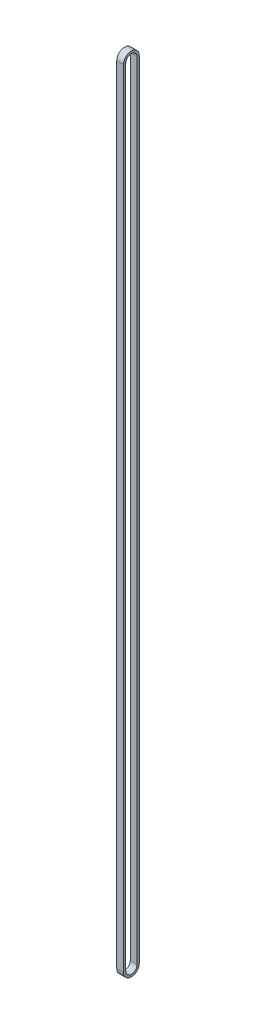
ISO-10303-21;
HEADER;
FILE_DESCRIPTION(('STEP AP214'),'2;1');
FILE_NAME('part.step','',(''),(''),'','','');
FILE_SCHEMA(('AUTOMOTIVE_DESIGN { 1 0 10303 214 1 1 1 1 }'));
ENDSEC;
DATA;
#1=APPLICATION_CONTEXT('core data for automotive mechanical design processes');
#2=APPLICATION_PROTOCOL_DEFINITION('international standard','automotive_design',2000,#1);
#3=PRODUCT_CONTEXT('',#1,'mechanical');
#4=PRODUCT('Part','Part','',(#3));
#5=PRODUCT_RELATED_PRODUCT_CATEGORY('part','',(#4));
#6=PRODUCT_DEFINITION_FORMATION('','',#4);
#7=PRODUCT_DEFINITION_CONTEXT('part definition',#1,'design');
#8=PRODUCT_DEFINITION('design','',#6,#7);
#9=PRODUCT_DEFINITION_SHAPE('','',#8);
#10=(LENGTH_UNIT() NAMED_UNIT(*) SI_UNIT(.MILLI.,.METRE.));
#11=(NAMED_UNIT(*) PLANE_ANGLE_UNIT() SI_UNIT($,.RADIAN.));
#12=(NAMED_UNIT(*) SI_UNIT($,.STERADIAN.) SOLID_ANGLE_UNIT());
#13=UNCERTAINTY_MEASURE_WITH_UNIT(LENGTH_MEASURE(1.E-05),#10,'distance_accuracy_value','');
#14=(GEOMETRIC_REPRESENTATION_CONTEXT(3) GLOBAL_UNCERTAINTY_ASSIGNED_CONTEXT((#13)) GLOBAL_UNIT_ASSIGNED_CONTEXT((#10,
#11,#12)) REPRESENTATION_CONTEXT('',''));
#15=CARTESIAN_POINT('',(0.,0.,0.));
#16=DIRECTION('',(0.,0.,1.));
#17=DIRECTION('',(1.,0.,0.));
#18=AXIS2_PLACEMENT_3D('',#15,#16,#17);
#19=CARTESIAN_POINT('',(3.,0.,0.));
#20=DIRECTION('',(1.,0.,0.));
#21=DIRECTION('',(0.,0.,-1.));
#22=AXIS2_PLACEMENT_3D('',#19,#20,#21);
#23=PLANE('',#22);
#24=CARTESIAN_POINT('',(3.,0.,0.));
#25=DIRECTION('',(1.,0.,0.));
#26=DIRECTION('',(0.,0.,-1.));
#27=AXIS2_PLACEMENT_3D('',#24,#25,#26);
#28=CIRCLE('',#27,7.);
#29=CARTESIAN_POINT('',(3.,0.,7.));
#30=VERTEX_POINT('',#29);
#31=CARTESIAN_POINT('',(3.,0.,-7.));
#32=VERTEX_POINT('',#31);
#33=EDGE_CURVE('E153',#30,#32,#28,.T.);
#34=ORIENTED_EDGE('',*,*,#33,.T.);
#35=DIRECTION('',(0.,1.,0.));
#36=VECTOR('',#35,1.);
#37=CARTESIAN_POINT('',(3.,0.,-7.));
#38=LINE('',#37,#36);
#39=CARTESIAN_POINT('',(3.,698.,-7.));
#40=VERTEX_POINT('',#39);
#41=EDGE_CURVE('E156',#32,#40,#38,.T.);
#42=ORIENTED_EDGE('',*,*,#41,.T.);
#43=CARTESIAN_POINT('',(3.,698.,0.));
#44=DIRECTION('',(1.,0.,0.));
#45=DIRECTION('',(0.,0.,-1.));
#46=AXIS2_PLACEMENT_3D('',#43,#44,#45);
#47=CIRCLE('',#46,7.);
#48=CARTESIAN_POINT('',(3.,698.,7.));
#49=VERTEX_POINT('',#48);
#50=EDGE_CURVE('E159',#40,#49,#47,.T.);
#51=ORIENTED_EDGE('',*,*,#50,.T.);
#52=DIRECTION('',(0.,-1.,0.));
#53=VECTOR('',#52,1.);
#54=CARTESIAN_POINT('',(3.,0.,7.));
#55=LINE('',#54,#53);
#56=EDGE_CURVE('E162',#49,#30,#55,.T.);
#57=ORIENTED_EDGE('',*,*,#56,.T.);
#58=EDGE_LOOP('',(#34,#42,#51,#57));
#59=FACE_BOUND('',#58,.T.);
#60=DIRECTION('',(0.,1.,0.));
#61=VECTOR('',#60,1.);
#62=CARTESIAN_POINT('',(3.,0.,-5.));
#63=LINE('',#62,#61);
#64=CARTESIAN_POINT('',(3.,0.,-5.));
#65=VERTEX_POINT('',#64);
#66=CARTESIAN_POINT('',(3.,698.,-5.));
#67=VERTEX_POINT('',#66);
#68=EDGE_CURVE('E115',#65,#67,#63,.T.);
#69=ORIENTED_EDGE('',*,*,#68,.F.);
#70=CARTESIAN_POINT('',(3.,0.,0.));
#71=DIRECTION('',(1.,0.,0.));
#72=DIRECTION('',(0.,0.,-1.));
#73=AXIS2_PLACEMENT_3D('',#70,#71,#72);
#74=CIRCLE('',#73,5.);
#75=CARTESIAN_POINT('',(3.,0.,5.));
#76=VERTEX_POINT('',#75);
#77=EDGE_CURVE('E107',#76,#65,#74,.T.);
#78=ORIENTED_EDGE('',*,*,#77,.F.);
#79=DIRECTION('',(0.,-1.,0.));
#80=VECTOR('',#79,1.);
#81=CARTESIAN_POINT('',(3.,0.,5.));
#82=LINE('',#81,#80);
#83=CARTESIAN_POINT('',(3.,698.,5.));
#84=VERTEX_POINT('',#83);
#85=EDGE_CURVE('E133',#84,#76,#82,.T.);
#86=ORIENTED_EDGE('',*,*,#85,.F.);
#87=CARTESIAN_POINT('',(3.,698.,0.));
#88=DIRECTION('',(1.,0.,0.));
#89=DIRECTION('',(0.,0.,-1.));
#90=AXIS2_PLACEMENT_3D('',#87,#88,#89);
#91=CIRCLE('',#90,5.);
#92=EDGE_CURVE('E127',#67,#84,#91,.T.);
#93=ORIENTED_EDGE('',*,*,#92,.F.);
#94=EDGE_LOOP('',(#69,#78,#86,#93));
#95=FACE_BOUND('',#94,.T.);
#96=ADVANCED_FACE('F34',(#59,#95),#23,.T.);
#97=CARTESIAN_POINT('',(-3.,0.,0.));
#98=DIRECTION('',(1.,0.,0.));
#99=DIRECTION('',(0.,0.,-1.));
#100=AXIS2_PLACEMENT_3D('',#97,#98,#99);
#101=PLANE('',#100);
#102=CARTESIAN_POINT('',(-3.,0.,0.));
#103=DIRECTION('',(1.,0.,0.));
#104=DIRECTION('',(0.,0.,-1.));
#105=AXIS2_PLACEMENT_3D('',#102,#103,#104);
#106=CIRCLE('',#105,7.);
#107=CARTESIAN_POINT('',(-3.,0.,7.));
#108=VERTEX_POINT('',#107);
#109=CARTESIAN_POINT('',(-3.,0.,-7.));
#110=VERTEX_POINT('',#109);
#111=EDGE_CURVE('E123',#108,#110,#106,.T.);
#112=ORIENTED_EDGE('',*,*,#111,.F.);
#113=DIRECTION('',(0.,-1.,0.));
#114=VECTOR('',#113,1.);
#115=CARTESIAN_POINT('',(-3.,0.,7.));
#116=LINE('',#115,#114);
#117=CARTESIAN_POINT('',(-3.,698.,7.));
#118=VERTEX_POINT('',#117);
#119=EDGE_CURVE('E157',#118,#108,#116,.T.);
#120=ORIENTED_EDGE('',*,*,#119,.F.);
#121=CARTESIAN_POINT('',(-3.,698.,0.));
#122=DIRECTION('',(1.,0.,0.));
#123=DIRECTION('',(0.,0.,-1.));
#124=AXIS2_PLACEMENT_3D('',#121,#122,#123);
#125=CIRCLE('',#124,7.);
#126=CARTESIAN_POINT('',(-3.,698.,-7.));
#127=VERTEX_POINT('',#126);
#128=EDGE_CURVE('E170',#127,#118,#125,.T.);
#129=ORIENTED_EDGE('',*,*,#128,.F.);
#130=DIRECTION('',(0.,1.,0.));
#131=VECTOR('',#130,1.);
#132=CARTESIAN_POINT('',(-3.,0.,-7.));
#133=LINE('',#132,#131);
#134=EDGE_CURVE('E167',#110,#127,#133,.T.);
#135=ORIENTED_EDGE('',*,*,#134,.F.);
#136=EDGE_LOOP('',(#112,#120,#129,#135));
#137=FACE_BOUND('',#136,.T.);
#138=CARTESIAN_POINT('',(-3.,0.,0.));
#139=DIRECTION('',(1.,0.,0.));
#140=DIRECTION('',(0.,0.,-1.));
#141=AXIS2_PLACEMENT_3D('',#138,#139,#140);
#142=CIRCLE('',#141,5.);
#143=CARTESIAN_POINT('',(-3.,0.,5.));
#144=VERTEX_POINT('',#143);
#145=CARTESIAN_POINT('',(-3.,0.,-5.));
#146=VERTEX_POINT('',#145);
#147=EDGE_CURVE('E60',#144,#146,#142,.T.);
#148=ORIENTED_EDGE('',*,*,#147,.T.);
#149=DIRECTION('',(0.,1.,0.));
#150=VECTOR('',#149,1.);
#151=CARTESIAN_POINT('',(-3.,0.,-5.));
#152=LINE('',#151,#150);
#153=CARTESIAN_POINT('',(-3.,698.,-5.));
#154=VERTEX_POINT('',#153);
#155=EDGE_CURVE('E122',#146,#154,#152,.T.);
#156=ORIENTED_EDGE('',*,*,#155,.T.);
#157=CARTESIAN_POINT('',(-3.,698.,0.));
#158=DIRECTION('',(1.,0.,0.));
#159=DIRECTION('',(0.,0.,-1.));
#160=AXIS2_PLACEMENT_3D('',#157,#158,#159);
#161=CIRCLE('',#160,5.);
#162=CARTESIAN_POINT('',(-3.,698.,5.));
#163=VERTEX_POINT('',#162);
#164=EDGE_CURVE('E141',#154,#163,#161,.T.);
#165=ORIENTED_EDGE('',*,*,#164,.T.);
#166=DIRECTION('',(0.,-1.,0.));
#167=VECTOR('',#166,1.);
#168=CARTESIAN_POINT('',(-3.,0.,5.));
#169=LINE('',#168,#167);
#170=EDGE_CURVE('E116',#163,#144,#169,.T.);
#171=ORIENTED_EDGE('',*,*,#170,.T.);
#172=EDGE_LOOP('',(#148,#156,#165,#171));
#173=FACE_BOUND('',#172,.T.);
#174=ADVANCED_FACE('F192',(#137,#173),#101,.F.);
#175=CARTESIAN_POINT('',(3.,0.,0.));
#176=DIRECTION('',(-1.,0.,0.));
#177=DIRECTION('',(0.,0.,1.));
#178=AXIS2_PLACEMENT_3D('',#175,#176,#177);
#179=CYLINDRICAL_SURFACE('',#178,7.);
#180=ORIENTED_EDGE('',*,*,#111,.T.);
#181=DIRECTION('',(-1.,0.,0.));
#182=VECTOR('',#181,1.);
#183=CARTESIAN_POINT('',(3.,0.,-7.));
#184=LINE('',#183,#182);
#185=EDGE_CURVE('E11',#32,#110,#184,.T.);
#186=ORIENTED_EDGE('',*,*,#185,.F.);
#187=ORIENTED_EDGE('',*,*,#33,.F.);
#188=DIRECTION('',(-1.,0.,0.));
#189=VECTOR('',#188,1.);
#190=CARTESIAN_POINT('',(3.,0.,7.));
#191=LINE('',#190,#189);
#192=EDGE_CURVE('E164',#30,#108,#191,.T.);
#193=ORIENTED_EDGE('',*,*,#192,.T.);
#194=EDGE_LOOP('',(#180,#186,#187,#193));
#195=FACE_BOUND('',#194,.T.);
#196=ADVANCED_FACE('F36',(#195),#179,.T.);
#197=CARTESIAN_POINT('',(3.,0.,-7.));
#198=DIRECTION('',(0.,0.,1.));
#199=DIRECTION('',(1.,0.,0.));
#200=AXIS2_PLACEMENT_3D('',#197,#198,#199);
#201=PLANE('',#200);
#202=ORIENTED_EDGE('',*,*,#134,.T.);
#203=DIRECTION('',(-1.,0.,0.));
#204=VECTOR('',#203,1.);
#205=CARTESIAN_POINT('',(3.,698.,-7.));
#206=LINE('',#205,#204);
#207=EDGE_CURVE('E42',#40,#127,#206,.T.);
#208=ORIENTED_EDGE('',*,*,#207,.F.);
#209=ORIENTED_EDGE('',*,*,#41,.F.);
#210=ORIENTED_EDGE('',*,*,#185,.T.);
#211=EDGE_LOOP('',(#202,#208,#209,#210));
#212=FACE_BOUND('',#211,.T.);
#213=ADVANCED_FACE('F202',(#212),#201,.F.);
#214=CARTESIAN_POINT('',(3.,698.,0.));
#215=DIRECTION('',(-1.,0.,0.));
#216=DIRECTION('',(0.,0.,1.));
#217=AXIS2_PLACEMENT_3D('',#214,#215,#216);
#218=CYLINDRICAL_SURFACE('',#217,7.);
#219=ORIENTED_EDGE('',*,*,#128,.T.);
#220=DIRECTION('',(-1.,0.,0.));
#221=VECTOR('',#220,1.);
#222=CARTESIAN_POINT('',(3.,698.,7.));
#223=LINE('',#222,#221);
#224=EDGE_CURVE('E177',#49,#118,#223,.T.);
#225=ORIENTED_EDGE('',*,*,#224,.F.);
#226=ORIENTED_EDGE('',*,*,#50,.F.);
#227=ORIENTED_EDGE('',*,*,#207,.T.);
#228=EDGE_LOOP('',(#219,#225,#226,#227));
#229=FACE_BOUND('',#228,.T.);
#230=ADVANCED_FACE('F186',(#229),#218,.T.);
#231=CARTESIAN_POINT('',(3.,0.,7.));
#232=DIRECTION('',(0.,0.,-1.));
#233=DIRECTION('',(-1.,0.,0.));
#234=AXIS2_PLACEMENT_3D('',#231,#232,#233);
#235=PLANE('',#234);
#236=ORIENTED_EDGE('',*,*,#119,.T.);
#237=ORIENTED_EDGE('',*,*,#192,.F.);
#238=ORIENTED_EDGE('',*,*,#56,.F.);
#239=ORIENTED_EDGE('',*,*,#224,.T.);
#240=EDGE_LOOP('',(#236,#237,#238,#239));
#241=FACE_BOUND('',#240,.T.);
#242=ADVANCED_FACE('F196',(#241),#235,.F.);
#243=CARTESIAN_POINT('',(3.,0.,0.));
#244=DIRECTION('',(-1.,0.,0.));
#245=DIRECTION('',(0.,0.,1.));
#246=AXIS2_PLACEMENT_3D('',#243,#244,#245);
#247=CYLINDRICAL_SURFACE('',#246,5.);
#248=ORIENTED_EDGE('',*,*,#147,.F.);
#249=DIRECTION('',(-1.,0.,0.));
#250=VECTOR('',#249,1.);
#251=CARTESIAN_POINT('',(3.,0.,5.));
#252=LINE('',#251,#250);
#253=EDGE_CURVE('E111',#76,#144,#252,.T.);
#254=ORIENTED_EDGE('',*,*,#253,.F.);
#255=ORIENTED_EDGE('',*,*,#77,.T.);
#256=DIRECTION('',(-1.,0.,0.));
#257=VECTOR('',#256,1.);
#258=CARTESIAN_POINT('',(3.,0.,-5.));
#259=LINE('',#258,#257);
#260=EDGE_CURVE('E110',#65,#146,#259,.T.);
#261=ORIENTED_EDGE('',*,*,#260,.T.);
#262=EDGE_LOOP('',(#248,#254,#255,#261));
#263=FACE_BOUND('',#262,.T.);
#264=ADVANCED_FACE('F109',(#263),#247,.F.);
#265=CARTESIAN_POINT('',(3.,0.,-5.));
#266=DIRECTION('',(0.,0.,1.));
#267=DIRECTION('',(1.,0.,0.));
#268=AXIS2_PLACEMENT_3D('',#265,#266,#267);
#269=PLANE('',#268);
#270=ORIENTED_EDGE('',*,*,#155,.F.);
#271=ORIENTED_EDGE('',*,*,#260,.F.);
#272=ORIENTED_EDGE('',*,*,#68,.T.);
#273=DIRECTION('',(-1.,0.,0.));
#274=VECTOR('',#273,1.);
#275=CARTESIAN_POINT('',(3.,698.,-5.));
#276=LINE('',#275,#274);
#277=EDGE_CURVE('E124',#67,#154,#276,.T.);
#278=ORIENTED_EDGE('',*,*,#277,.T.);
#279=EDGE_LOOP('',(#270,#271,#272,#278));
#280=FACE_BOUND('',#279,.T.);
#281=ADVANCED_FACE('F119',(#280),#269,.T.);
#282=CARTESIAN_POINT('',(3.,698.,0.));
#283=DIRECTION('',(-1.,0.,0.));
#284=DIRECTION('',(0.,0.,1.));
#285=AXIS2_PLACEMENT_3D('',#282,#283,#284);
#286=CYLINDRICAL_SURFACE('',#285,5.);
#287=ORIENTED_EDGE('',*,*,#164,.F.);
#288=ORIENTED_EDGE('',*,*,#277,.F.);
#289=ORIENTED_EDGE('',*,*,#92,.T.);
#290=DIRECTION('',(-1.,0.,0.));
#291=VECTOR('',#290,1.);
#292=CARTESIAN_POINT('',(3.,698.,5.));
#293=LINE('',#292,#291);
#294=EDGE_CURVE('E52',#84,#163,#293,.T.);
#295=ORIENTED_EDGE('',*,*,#294,.T.);
#296=EDGE_LOOP('',(#287,#288,#289,#295));
#297=FACE_BOUND('',#296,.T.);
#298=ADVANCED_FACE('F225',(#297),#286,.F.);
#299=CARTESIAN_POINT('',(3.,0.,5.));
#300=DIRECTION('',(0.,0.,-1.));
#301=DIRECTION('',(-1.,0.,0.));
#302=AXIS2_PLACEMENT_3D('',#299,#300,#301);
#303=PLANE('',#302);
#304=ORIENTED_EDGE('',*,*,#170,.F.);
#305=ORIENTED_EDGE('',*,*,#294,.F.);
#306=ORIENTED_EDGE('',*,*,#85,.T.);
#307=ORIENTED_EDGE('',*,*,#253,.T.);
#308=EDGE_LOOP('',(#304,#305,#306,#307));
#309=FACE_BOUND('',#308,.T.);
#310=ADVANCED_FACE('F229',(#309),#303,.T.);
#311=CLOSED_SHELL('',(#96,#174,#196,#213,#230,#242,#264,#281,#298,#310));
#312=MANIFOLD_SOLID_BREP('B2',#311);
#313=ADVANCED_BREP_SHAPE_REPRESENTATION('',(#18,#312),#14);
#314=SHAPE_DEFINITION_REPRESENTATION(#9,#313);
ENDSEC;
END-ISO-10303-21;
